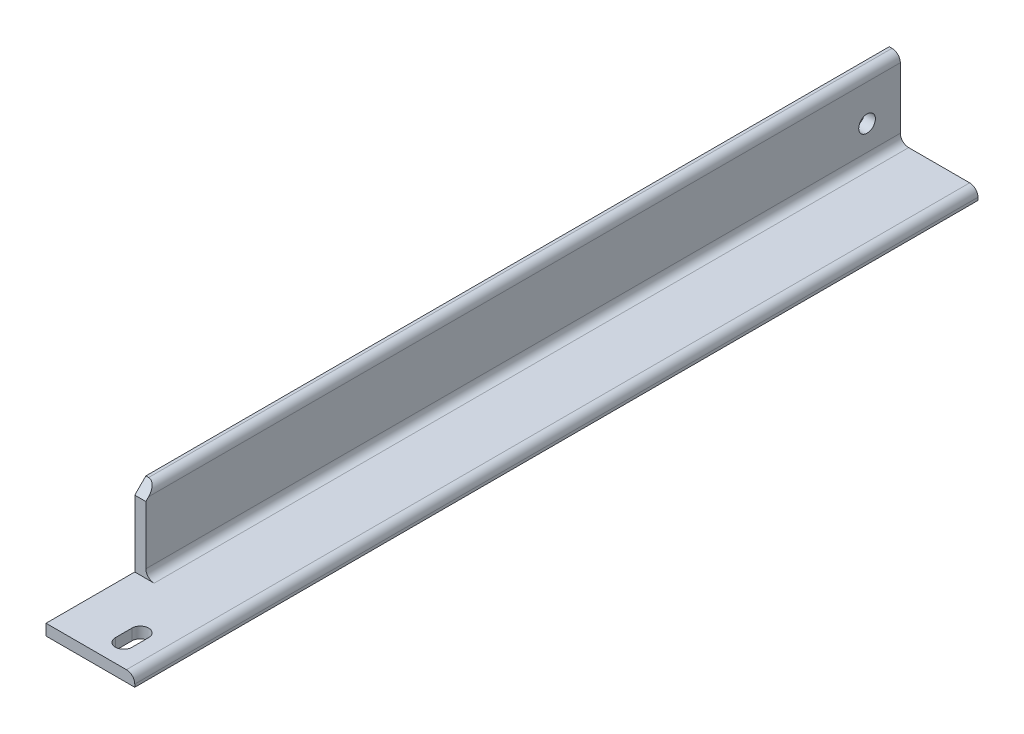
ISO-10303-21;
HEADER;
FILE_DESCRIPTION(('STEP AP214'),'2;1');
FILE_NAME('part.step','',(''),(''),'','','');
FILE_SCHEMA(('AUTOMOTIVE_DESIGN { 1 0 10303 214 1 1 1 1 }'));
ENDSEC;
DATA;
#1=APPLICATION_CONTEXT('core data for automotive mechanical design processes');
#2=APPLICATION_PROTOCOL_DEFINITION('international standard','automotive_design',2000,#1);
#3=PRODUCT_CONTEXT('',#1,'mechanical');
#4=PRODUCT('Part','Part','',(#3));
#5=PRODUCT_RELATED_PRODUCT_CATEGORY('part','',(#4));
#6=PRODUCT_DEFINITION_FORMATION('','',#4);
#7=PRODUCT_DEFINITION_CONTEXT('part definition',#1,'design');
#8=PRODUCT_DEFINITION('design','',#6,#7);
#9=PRODUCT_DEFINITION_SHAPE('','',#8);
#10=(LENGTH_UNIT() NAMED_UNIT(*) SI_UNIT(.MILLI.,.METRE.));
#11=(NAMED_UNIT(*) PLANE_ANGLE_UNIT() SI_UNIT($,.RADIAN.));
#12=(NAMED_UNIT(*) SI_UNIT($,.STERADIAN.) SOLID_ANGLE_UNIT());
#13=UNCERTAINTY_MEASURE_WITH_UNIT(LENGTH_MEASURE(1.E-05),#10,'distance_accuracy_value','');
#14=(GEOMETRIC_REPRESENTATION_CONTEXT(3) GLOBAL_UNCERTAINTY_ASSIGNED_CONTEXT((#13)) GLOBAL_UNIT_ASSIGNED_CONTEXT((#10,
#11,#12)) REPRESENTATION_CONTEXT('',''));
#15=CARTESIAN_POINT('',(0.,0.,0.));
#16=DIRECTION('',(0.,0.,1.));
#17=DIRECTION('',(1.,0.,0.));
#18=AXIS2_PLACEMENT_3D('',#15,#16,#17);
#19=CARTESIAN_POINT('',(0.,0.,482.6));
#20=DIRECTION('',(1.,0.,0.));
#21=DIRECTION('',(0.,0.,-1.));
#22=AXIS2_PLACEMENT_3D('',#19,#20,#21);
#23=PLANE('',#22);
#24=DIRECTION('',(0.,0.707106781186548,-0.707106781186548));
#25=VECTOR('',#24,1.);
#26=CARTESIAN_POINT('',(0.,88.9,381.));
#27=LINE('',#26,#25);
#28=CARTESIAN_POINT('',(0.,88.9,381.));
#29=VERTEX_POINT('',#28);
#30=CARTESIAN_POINT('',(0.,101.6,368.3));
#31=VERTEX_POINT('',#30);
#32=EDGE_CURVE('E166',#29,#31,#27,.T.);
#33=ORIENTED_EDGE('',*,*,#32,.T.);
#34=DIRECTION('',(0.,0.,-1.));
#35=VECTOR('',#34,1.);
#36=CARTESIAN_POINT('',(0.,101.6,482.6));
#37=LINE('',#36,#35);
#38=CARTESIAN_POINT('',(0.,101.6,-482.6));
#39=VERTEX_POINT('',#38);
#40=EDGE_CURVE('E222',#31,#39,#37,.T.);
#41=ORIENTED_EDGE('',*,*,#40,.T.);
#42=DIRECTION('',(0.,-1.,0.));
#43=VECTOR('',#42,1.);
#44=CARTESIAN_POINT('',(0.,0.,-482.6));
#45=LINE('',#44,#43);
#46=CARTESIAN_POINT('',(0.,0.,-482.6));
#47=VERTEX_POINT('',#46);
#48=EDGE_CURVE('E189',#39,#47,#45,.T.);
#49=ORIENTED_EDGE('',*,*,#48,.T.);
#50=DIRECTION('',(0.,0.,-1.));
#51=VECTOR('',#50,1.);
#52=CARTESIAN_POINT('',(0.,0.,482.6));
#53=LINE('',#52,#51);
#54=CARTESIAN_POINT('',(0.,0.,482.6));
#55=VERTEX_POINT('',#54);
#56=EDGE_CURVE('E197',#55,#47,#53,.T.);
#57=ORIENTED_EDGE('',*,*,#56,.F.);
#58=DIRECTION('',(0.,-1.,0.));
#59=VECTOR('',#58,1.);
#60=CARTESIAN_POINT('',(0.,0.,482.6));
#61=LINE('',#60,#59);
#62=CARTESIAN_POINT('',(0.,12.7,482.6));
#63=VERTEX_POINT('',#62);
#64=EDGE_CURVE('E195',#63,#55,#61,.T.);
#65=ORIENTED_EDGE('',*,*,#64,.F.);
#66=DIRECTION('',(0.,0.,-1.));
#67=VECTOR('',#66,1.);
#68=CARTESIAN_POINT('',(0.,12.7,482.6));
#69=LINE('',#68,#67);
#70=CARTESIAN_POINT('',(0.,12.7,381.));
#71=VERTEX_POINT('',#70);
#72=EDGE_CURVE('E160',#63,#71,#69,.T.);
#73=ORIENTED_EDGE('',*,*,#72,.T.);
#74=DIRECTION('',(0.,1.,0.));
#75=VECTOR('',#74,1.);
#76=CARTESIAN_POINT('',(0.,12.7,381.));
#77=LINE('',#76,#75);
#78=EDGE_CURVE('E163',#71,#29,#77,.T.);
#79=ORIENTED_EDGE('',*,*,#78,.T.);
#80=EDGE_LOOP('',(#33,#41,#49,#57,#65,#73,#79));
#81=FACE_BOUND('',#80,.T.);
#82=CARTESIAN_POINT('',(0.,50.8,-444.5));
#83=DIRECTION('',(-1.,0.,0.));
#84=DIRECTION('',(0.,0.,1.));
#85=AXIS2_PLACEMENT_3D('',#82,#83,#84);
#86=CIRCLE('',#85,9.525);
#87=CARTESIAN_POINT('',(0.,50.8,-434.975));
#88=VERTEX_POINT('',#87);
#89=EDGE_CURVE('E449',#88,#88,#86,.T.);
#90=ORIENTED_EDGE('',*,*,#89,.F.);
#91=EDGE_LOOP('',(#90));
#92=FACE_BOUND('',#91,.T.);
#93=ADVANCED_FACE('F17',(#81,#92),#23,.F.);
#94=CARTESIAN_POINT('',(101.6,0.,482.6));
#95=DIRECTION('',(0.,1.,0.));
#96=DIRECTION('',(-1.,0.,0.));
#97=AXIS2_PLACEMENT_3D('',#94,#95,#96);
#98=PLANE('',#97);
#99=DIRECTION('',(1.,0.,0.));
#100=VECTOR('',#99,1.);
#101=CARTESIAN_POINT('',(101.6,0.,-482.6));
#102=LINE('',#101,#100);
#103=CARTESIAN_POINT('',(101.6,0.,-482.6));
#104=VERTEX_POINT('',#103);
#105=EDGE_CURVE('E184',#47,#104,#102,.T.);
#106=ORIENTED_EDGE('',*,*,#105,.T.);
#107=DIRECTION('',(0.,0.,-1.));
#108=VECTOR('',#107,1.);
#109=CARTESIAN_POINT('',(101.6,0.,482.6));
#110=LINE('',#109,#108);
#111=CARTESIAN_POINT('',(101.6,0.,482.6));
#112=VERTEX_POINT('',#111);
#113=EDGE_CURVE('E11',#112,#104,#110,.T.);
#114=ORIENTED_EDGE('',*,*,#113,.F.);
#115=DIRECTION('',(1.,0.,0.));
#116=VECTOR('',#115,1.);
#117=CARTESIAN_POINT('',(101.6,0.,482.6));
#118=LINE('',#117,#116);
#119=EDGE_CURVE('E185',#55,#112,#118,.T.);
#120=ORIENTED_EDGE('',*,*,#119,.F.);
#121=ORIENTED_EDGE('',*,*,#56,.T.);
#122=EDGE_LOOP('',(#106,#114,#120,#121));
#123=FACE_BOUND('',#122,.T.);
#124=CARTESIAN_POINT('',(63.5,0.,457.2));
#125=DIRECTION('',(0.,1.,0.));
#126=DIRECTION('',(-1.,0.,0.));
#127=AXIS2_PLACEMENT_3D('',#124,#125,#126);
#128=CIRCLE('',#127,9.525);
#129=CARTESIAN_POINT('',(53.975,0.,457.2));
#130=VERTEX_POINT('',#129);
#131=CARTESIAN_POINT('',(73.025,0.,457.2));
#132=VERTEX_POINT('',#131);
#133=EDGE_CURVE('E32',#130,#132,#128,.T.);
#134=ORIENTED_EDGE('',*,*,#133,.T.);
#135=DIRECTION('',(0.,0.,-1.));
#136=VECTOR('',#135,1.);
#137=CARTESIAN_POINT('',(73.025,0.,457.2));
#138=LINE('',#137,#136);
#139=CARTESIAN_POINT('',(73.025,0.,438.15));
#140=VERTEX_POINT('',#139);
#141=EDGE_CURVE('E142',#132,#140,#138,.T.);
#142=ORIENTED_EDGE('',*,*,#141,.T.);
#143=CARTESIAN_POINT('',(63.5,0.,438.15));
#144=DIRECTION('',(0.,1.,0.));
#145=DIRECTION('',(-1.,0.,0.));
#146=AXIS2_PLACEMENT_3D('',#143,#144,#145);
#147=CIRCLE('',#146,9.525);
#148=CARTESIAN_POINT('',(53.975,0.,438.15));
#149=VERTEX_POINT('',#148);
#150=EDGE_CURVE('E150',#140,#149,#147,.T.);
#151=ORIENTED_EDGE('',*,*,#150,.T.);
#152=DIRECTION('',(0.,0.,1.));
#153=VECTOR('',#152,1.);
#154=CARTESIAN_POINT('',(53.975,0.,457.2));
#155=LINE('',#154,#153);
#156=EDGE_CURVE('E136',#149,#130,#155,.T.);
#157=ORIENTED_EDGE('',*,*,#156,.T.);
#158=EDGE_LOOP('',(#134,#142,#151,#157));
#159=FACE_BOUND('',#158,.T.);
#160=ADVANCED_FACE('F19',(#123,#159),#98,.F.);
#161=CARTESIAN_POINT('',(22.225,12.7,482.6));
#162=DIRECTION('',(0.,-1.,0.));
#163=DIRECTION('',(1.,0.,0.));
#164=AXIS2_PLACEMENT_3D('',#161,#162,#163);
#165=PLANE('',#164);
#166=DIRECTION('',(-1.,0.,0.));
#167=VECTOR('',#166,1.);
#168=CARTESIAN_POINT('',(22.225,12.7,-482.6));
#169=LINE('',#168,#167);
#170=CARTESIAN_POINT('',(92.08008,12.7,-482.6));
#171=VERTEX_POINT('',#170);
#172=CARTESIAN_POINT('',(22.225,12.7,-482.6));
#173=VERTEX_POINT('',#172);
#174=EDGE_CURVE('E204',#171,#173,#169,.T.);
#175=ORIENTED_EDGE('',*,*,#174,.T.);
#176=DIRECTION('',(0.,0.,-1.));
#177=VECTOR('',#176,1.);
#178=CARTESIAN_POINT('',(22.225,12.7,482.6));
#179=LINE('',#178,#177);
#180=CARTESIAN_POINT('',(22.225,12.7,381.));
#181=VERTEX_POINT('',#180);
#182=EDGE_CURVE('E230',#181,#173,#179,.T.);
#183=ORIENTED_EDGE('',*,*,#182,.F.);
#184=DIRECTION('',(-1.,0.,0.));
#185=VECTOR('',#184,1.);
#186=CARTESIAN_POINT('',(101.601,12.7,381.));
#187=LINE('',#186,#185);
#188=EDGE_CURVE('E173',#181,#71,#187,.T.);
#189=ORIENTED_EDGE('',*,*,#188,.T.);
#190=ORIENTED_EDGE('',*,*,#72,.F.);
#191=DIRECTION('',(-1.,0.,0.));
#192=VECTOR('',#191,1.);
#193=CARTESIAN_POINT('',(22.225,12.7,482.6));
#194=LINE('',#193,#192);
#195=CARTESIAN_POINT('',(92.08008,12.7,482.6));
#196=VERTEX_POINT('',#195);
#197=EDGE_CURVE('E193',#196,#63,#194,.T.);
#198=ORIENTED_EDGE('',*,*,#197,.F.);
#199=DIRECTION('',(0.,0.,-1.));
#200=VECTOR('',#199,1.);
#201=CARTESIAN_POINT('',(92.08008,12.7,482.6));
#202=LINE('',#201,#200);
#203=EDGE_CURVE('E232',#196,#171,#202,.T.);
#204=ORIENTED_EDGE('',*,*,#203,.T.);
#205=EDGE_LOOP('',(#175,#183,#189,#190,#198,#204));
#206=FACE_BOUND('',#205,.T.);
#207=CARTESIAN_POINT('',(63.5,12.7,457.2));
#208=DIRECTION('',(0.,-1.,0.));
#209=DIRECTION('',(1.,0.,0.));
#210=AXIS2_PLACEMENT_3D('',#207,#208,#209);
#211=CIRCLE('',#210,9.525);
#212=CARTESIAN_POINT('',(73.025,12.7,457.2));
#213=VERTEX_POINT('',#212);
#214=CARTESIAN_POINT('',(53.975,12.7,457.2));
#215=VERTEX_POINT('',#214);
#216=EDGE_CURVE('E134',#213,#215,#211,.T.);
#217=ORIENTED_EDGE('',*,*,#216,.T.);
#218=DIRECTION('',(0.,0.,-1.));
#219=VECTOR('',#218,1.);
#220=CARTESIAN_POINT('',(53.975,12.7,457.2));
#221=LINE('',#220,#219);
#222=CARTESIAN_POINT('',(53.975,12.7,438.15));
#223=VERTEX_POINT('',#222);
#224=EDGE_CURVE('E123',#215,#223,#221,.T.);
#225=ORIENTED_EDGE('',*,*,#224,.T.);
#226=CARTESIAN_POINT('',(63.5,12.7,438.15));
#227=DIRECTION('',(0.,-1.,0.));
#228=DIRECTION('',(1.,0.,0.));
#229=AXIS2_PLACEMENT_3D('',#226,#227,#228);
#230=CIRCLE('',#229,9.525);
#231=CARTESIAN_POINT('',(73.025,12.7,438.15));
#232=VERTEX_POINT('',#231);
#233=EDGE_CURVE('E144',#223,#232,#230,.T.);
#234=ORIENTED_EDGE('',*,*,#233,.T.);
#235=DIRECTION('',(0.,0.,1.));
#236=VECTOR('',#235,1.);
#237=CARTESIAN_POINT('',(73.025,12.7,457.2));
#238=LINE('',#237,#236);
#239=EDGE_CURVE('E140',#232,#213,#238,.T.);
#240=ORIENTED_EDGE('',*,*,#239,.T.);
#241=EDGE_LOOP('',(#217,#225,#234,#240));
#242=FACE_BOUND('',#241,.T.);
#243=ADVANCED_FACE('F139',(#206,#242),#165,.F.);
#244=CARTESIAN_POINT('',(22.225,22.225,482.6));
#245=DIRECTION('',(0.,0.,-1.));
#246=DIRECTION('',(-1.,0.,0.));
#247=AXIS2_PLACEMENT_3D('',#244,#245,#246);
#248=CYLINDRICAL_SURFACE('',#247,9.525);
#249=CARTESIAN_POINT('',(22.225,22.225,381.));
#250=DIRECTION('',(0.,0.,1.));
#251=DIRECTION('',(1.,0.,0.));
#252=AXIS2_PLACEMENT_3D('',#249,#250,#251);
#253=CIRCLE('',#252,9.525);
#254=CARTESIAN_POINT('',(12.7,22.225,381.));
#255=VERTEX_POINT('',#254);
#256=EDGE_CURVE('E181',#255,#181,#253,.T.);
#257=ORIENTED_EDGE('',*,*,#256,.T.);
#258=ORIENTED_EDGE('',*,*,#182,.T.);
#259=CARTESIAN_POINT('',(22.225,22.225,-482.6));
#260=DIRECTION('',(0.,0.,-1.));
#261=DIRECTION('',(-1.,0.,0.));
#262=AXIS2_PLACEMENT_3D('',#259,#260,#261);
#263=CIRCLE('',#262,9.525);
#264=CARTESIAN_POINT('',(12.7,22.225,-482.6));
#265=VERTEX_POINT('',#264);
#266=EDGE_CURVE('E207',#173,#265,#263,.T.);
#267=ORIENTED_EDGE('',*,*,#266,.T.);
#268=DIRECTION('',(0.,0.,-1.));
#269=VECTOR('',#268,1.);
#270=CARTESIAN_POINT('',(12.7,22.225,482.6));
#271=LINE('',#270,#269);
#272=EDGE_CURVE('E228',#255,#265,#271,.T.);
#273=ORIENTED_EDGE('',*,*,#272,.F.);
#274=EDGE_LOOP('',(#257,#258,#267,#273));
#275=FACE_BOUND('',#274,.T.);
#276=ADVANCED_FACE('F279',(#275),#248,.F.);
#277=CARTESIAN_POINT('',(12.7,92.08008,482.6));
#278=DIRECTION('',(-1.,0.,0.));
#279=DIRECTION('',(0.,-1.,0.));
#280=AXIS2_PLACEMENT_3D('',#277,#278,#279);
#281=PLANE('',#280);
#282=CARTESIAN_POINT('',(12.7,50.8,-444.5));
#283=DIRECTION('',(-1.,0.,0.));
#284=DIRECTION('',(0.,-1.,0.));
#285=AXIS2_PLACEMENT_3D('',#282,#283,#284);
#286=CIRCLE('',#285,9.525);
#287=CARTESIAN_POINT('',(12.7,41.275,-444.5));
#288=VERTEX_POINT('',#287);
#289=EDGE_CURVE('E446',#288,#288,#286,.T.);
#290=ORIENTED_EDGE('',*,*,#289,.T.);
#291=EDGE_LOOP('',(#290));
#292=FACE_BOUND('',#291,.T.);
#293=DIRECTION('',(0.,-1.,0.));
#294=VECTOR('',#293,1.);
#295=CARTESIAN_POINT('',(12.7,12.7,381.));
#296=LINE('',#295,#294);
#297=CARTESIAN_POINT('',(12.7,88.9,381.));
#298=VERTEX_POINT('',#297);
#299=EDGE_CURVE('E130',#298,#255,#296,.T.);
#300=ORIENTED_EDGE('',*,*,#299,.T.);
#301=ORIENTED_EDGE('',*,*,#272,.T.);
#302=DIRECTION('',(0.,1.,0.));
#303=VECTOR('',#302,1.);
#304=CARTESIAN_POINT('',(12.7,92.08008,-482.6));
#305=LINE('',#304,#303);
#306=CARTESIAN_POINT('',(12.7,92.08008,-482.6));
#307=VERTEX_POINT('',#306);
#308=EDGE_CURVE('E210',#265,#307,#305,.T.);
#309=ORIENTED_EDGE('',*,*,#308,.T.);
#310=DIRECTION('',(0.,0.,-1.));
#311=VECTOR('',#310,1.);
#312=CARTESIAN_POINT('',(12.7,92.08008,482.6));
#313=LINE('',#312,#311);
#314=CARTESIAN_POINT('',(12.7,92.08008,377.81992));
#315=VERTEX_POINT('',#314);
#316=EDGE_CURVE('E226',#315,#307,#313,.T.);
#317=ORIENTED_EDGE('',*,*,#316,.F.);
#318=DIRECTION('',(0.,-0.707106781186548,0.707106781186548));
#319=VECTOR('',#318,1.);
#320=CARTESIAN_POINT('',(12.7,88.9,381.));
#321=LINE('',#320,#319);
#322=EDGE_CURVE('E178',#315,#298,#321,.T.);
#323=ORIENTED_EDGE('',*,*,#322,.T.);
#324=EDGE_LOOP('',(#300,#301,#309,#317,#323));
#325=FACE_BOUND('',#324,.T.);
#326=ADVANCED_FACE('F276',(#292,#325),#281,.F.);
#327=CARTESIAN_POINT('',(3.18008,92.08008,482.6));
#328=DIRECTION('',(0.,0.,-1.));
#329=DIRECTION('',(-1.,0.,0.));
#330=AXIS2_PLACEMENT_3D('',#327,#328,#329);
#331=CYLINDRICAL_SURFACE('',#330,9.51992);
#332=CARTESIAN_POINT('',(3.18008,92.08008,377.81992));
#333=DIRECTION('',(0.,0.707106781186548,0.707106781186548));
#334=DIRECTION('',(0.,0.707106781186548,-0.707106781186548));
#335=AXIS2_PLACEMENT_3D('',#332,#333,#334);
#336=ELLIPSE('',#335,13.4631999767069,9.51992);
#337=CARTESIAN_POINT('',(3.18008,101.6,368.3));
#338=VERTEX_POINT('',#337);
#339=EDGE_CURVE('E175',#338,#315,#336,.F.);
#340=ORIENTED_EDGE('',*,*,#339,.T.);
#341=ORIENTED_EDGE('',*,*,#316,.T.);
#342=CARTESIAN_POINT('',(3.18008,92.08008,-482.6));
#343=DIRECTION('',(0.,0.,1.));
#344=DIRECTION('',(-1.,0.,0.));
#345=AXIS2_PLACEMENT_3D('',#342,#343,#344);
#346=CIRCLE('',#345,9.51992);
#347=CARTESIAN_POINT('',(3.18008,101.6,-482.6));
#348=VERTEX_POINT('',#347);
#349=EDGE_CURVE('E213',#307,#348,#346,.T.);
#350=ORIENTED_EDGE('',*,*,#349,.T.);
#351=DIRECTION('',(0.,0.,-1.));
#352=VECTOR('',#351,1.);
#353=CARTESIAN_POINT('',(3.18008,101.6,482.6));
#354=LINE('',#353,#352);
#355=EDGE_CURVE('E224',#338,#348,#354,.T.);
#356=ORIENTED_EDGE('',*,*,#355,.F.);
#357=EDGE_LOOP('',(#340,#341,#350,#356));
#358=FACE_BOUND('',#357,.T.);
#359=ADVANCED_FACE('F273',(#358),#331,.T.);
#360=CARTESIAN_POINT('',(0.,101.6,482.6));
#361=DIRECTION('',(0.,-1.,0.));
#362=DIRECTION('',(0.,0.,-1.));
#363=AXIS2_PLACEMENT_3D('',#360,#361,#362);
#364=PLANE('',#363);
#365=DIRECTION('',(-1.,0.,0.));
#366=VECTOR('',#365,1.);
#367=CARTESIAN_POINT('',(101.601,101.6,368.3));
#368=LINE('',#367,#366);
#369=EDGE_CURVE('E169',#338,#31,#368,.T.);
#370=ORIENTED_EDGE('',*,*,#369,.F.);
#371=ORIENTED_EDGE('',*,*,#355,.T.);
#372=DIRECTION('',(-1.,0.,0.));
#373=VECTOR('',#372,1.);
#374=CARTESIAN_POINT('',(0.,101.6,-482.6));
#375=LINE('',#374,#373);
#376=EDGE_CURVE('E216',#348,#39,#375,.T.);
#377=ORIENTED_EDGE('',*,*,#376,.T.);
#378=ORIENTED_EDGE('',*,*,#40,.F.);
#379=EDGE_LOOP('',(#370,#371,#377,#378));
#380=FACE_BOUND('',#379,.T.);
#381=ADVANCED_FACE('F270',(#380),#364,.F.);
#382=CARTESIAN_POINT('',(3.18008,92.08008,482.6));
#383=DIRECTION('',(0.,0.,-1.));
#384=DIRECTION('',(-1.,0.,0.));
#385=AXIS2_PLACEMENT_3D('',#382,#383,#384);
#386=PLANE('',#385);
#387=ORIENTED_EDGE('',*,*,#197,.T.);
#388=ORIENTED_EDGE('',*,*,#64,.T.);
#389=ORIENTED_EDGE('',*,*,#119,.T.);
#390=DIRECTION('',(0.,1.,0.));
#391=VECTOR('',#390,1.);
#392=CARTESIAN_POINT('',(101.6,3.18008,482.6));
#393=LINE('',#392,#391);
#394=CARTESIAN_POINT('',(101.6,3.18008,482.6));
#395=VERTEX_POINT('',#394);
#396=EDGE_CURVE('E188',#112,#395,#393,.T.);
#397=ORIENTED_EDGE('',*,*,#396,.T.);
#398=CARTESIAN_POINT('',(92.08008,3.18008,482.6));
#399=DIRECTION('',(0.,0.,1.));
#400=DIRECTION('',(1.,0.,0.));
#401=AXIS2_PLACEMENT_3D('',#398,#399,#400);
#402=CIRCLE('',#401,9.51992);
#403=EDGE_CURVE('E191',#395,#196,#402,.T.);
#404=ORIENTED_EDGE('',*,*,#403,.T.);
#405=EDGE_LOOP('',(#387,#388,#389,#397,#404));
#406=FACE_BOUND('',#405,.T.);
#407=ADVANCED_FACE('F254',(#406),#386,.F.);
#408=CARTESIAN_POINT('',(101.6,3.18008,482.6));
#409=DIRECTION('',(-1.,0.,0.));
#410=DIRECTION('',(0.,0.,1.));
#411=AXIS2_PLACEMENT_3D('',#408,#409,#410);
#412=PLANE('',#411);
#413=DIRECTION('',(0.,1.,0.));
#414=VECTOR('',#413,1.);
#415=CARTESIAN_POINT('',(101.6,3.18008,-482.6));
#416=LINE('',#415,#414);
#417=CARTESIAN_POINT('',(101.6,3.18008,-482.6));
#418=VERTEX_POINT('',#417);
#419=EDGE_CURVE('E200',#104,#418,#416,.T.);
#420=ORIENTED_EDGE('',*,*,#419,.T.);
#421=DIRECTION('',(0.,0.,-1.));
#422=VECTOR('',#421,1.);
#423=CARTESIAN_POINT('',(101.6,3.18008,482.6));
#424=LINE('',#423,#422);
#425=EDGE_CURVE('E25',#395,#418,#424,.T.);
#426=ORIENTED_EDGE('',*,*,#425,.F.);
#427=ORIENTED_EDGE('',*,*,#396,.F.);
#428=ORIENTED_EDGE('',*,*,#113,.T.);
#429=EDGE_LOOP('',(#420,#426,#427,#428));
#430=FACE_BOUND('',#429,.T.);
#431=ADVANCED_FACE('F258',(#430),#412,.F.);
#432=CARTESIAN_POINT('',(92.08008,3.18008,482.6));
#433=DIRECTION('',(0.,0.,-1.));
#434=DIRECTION('',(-1.,0.,0.));
#435=AXIS2_PLACEMENT_3D('',#432,#433,#434);
#436=CYLINDRICAL_SURFACE('',#435,9.51992);
#437=CARTESIAN_POINT('',(92.08008,3.18008,-482.6));
#438=DIRECTION('',(0.,0.,1.));
#439=DIRECTION('',(1.,0.,0.));
#440=AXIS2_PLACEMENT_3D('',#437,#438,#439);
#441=CIRCLE('',#440,9.51992);
#442=EDGE_CURVE('E202',#418,#171,#441,.T.);
#443=ORIENTED_EDGE('',*,*,#442,.T.);
#444=ORIENTED_EDGE('',*,*,#203,.F.);
#445=ORIENTED_EDGE('',*,*,#403,.F.);
#446=ORIENTED_EDGE('',*,*,#425,.T.);
#447=EDGE_LOOP('',(#443,#444,#445,#446));
#448=FACE_BOUND('',#447,.T.);
#449=ADVANCED_FACE('F239',(#448),#436,.T.);
#450=CARTESIAN_POINT('',(3.18008,92.08008,-482.6));
#451=DIRECTION('',(0.,0.,-1.));
#452=DIRECTION('',(-1.,0.,0.));
#453=AXIS2_PLACEMENT_3D('',#450,#451,#452);
#454=PLANE('',#453);
#455=ORIENTED_EDGE('',*,*,#105,.F.);
#456=ORIENTED_EDGE('',*,*,#48,.F.);
#457=ORIENTED_EDGE('',*,*,#376,.F.);
#458=ORIENTED_EDGE('',*,*,#349,.F.);
#459=ORIENTED_EDGE('',*,*,#308,.F.);
#460=ORIENTED_EDGE('',*,*,#266,.F.);
#461=ORIENTED_EDGE('',*,*,#174,.F.);
#462=ORIENTED_EDGE('',*,*,#442,.F.);
#463=ORIENTED_EDGE('',*,*,#419,.F.);
#464=EDGE_LOOP('',(#455,#456,#457,#458,#459,#460,#461,#462,#463));
#465=FACE_BOUND('',#464,.T.);
#466=ADVANCED_FACE('F245',(#465),#454,.T.);
#467=CARTESIAN_POINT('',(101.601,12.7,381.));
#468=DIRECTION('',(0.,0.,1.));
#469=DIRECTION('',(1.,0.,0.));
#470=AXIS2_PLACEMENT_3D('',#467,#468,#469);
#471=PLANE('',#470);
#472=ORIENTED_EDGE('',*,*,#299,.F.);
#473=DIRECTION('',(-1.,0.,0.));
#474=VECTOR('',#473,1.);
#475=CARTESIAN_POINT('',(101.601,88.9,381.));
#476=LINE('',#475,#474);
#477=EDGE_CURVE('E171',#298,#29,#476,.T.);
#478=ORIENTED_EDGE('',*,*,#477,.T.);
#479=ORIENTED_EDGE('',*,*,#78,.F.);
#480=ORIENTED_EDGE('',*,*,#188,.F.);
#481=ORIENTED_EDGE('',*,*,#256,.F.);
#482=EDGE_LOOP('',(#472,#478,#479,#480,#481));
#483=FACE_BOUND('',#482,.T.);
#484=ADVANCED_FACE('F281',(#483),#471,.T.);
#485=CARTESIAN_POINT('',(101.601,88.9,381.));
#486=DIRECTION('',(0.,0.707106781186548,0.707106781186548));
#487=DIRECTION('',(0.,-0.707106781186548,0.707106781186548));
#488=AXIS2_PLACEMENT_3D('',#485,#486,#487);
#489=PLANE('',#488);
#490=ORIENTED_EDGE('',*,*,#339,.F.);
#491=ORIENTED_EDGE('',*,*,#369,.T.);
#492=ORIENTED_EDGE('',*,*,#32,.F.);
#493=ORIENTED_EDGE('',*,*,#477,.F.);
#494=ORIENTED_EDGE('',*,*,#322,.F.);
#495=EDGE_LOOP('',(#490,#491,#492,#493,#494));
#496=FACE_BOUND('',#495,.T.);
#497=ADVANCED_FACE('F285',(#496),#489,.T.);
#498=CARTESIAN_POINT('',(63.5,101.601,457.2));
#499=DIRECTION('',(0.,-1.,0.));
#500=DIRECTION('',(1.,0.,0.));
#501=AXIS2_PLACEMENT_3D('',#498,#499,#500);
#502=CYLINDRICAL_SURFACE('',#501,9.525);
#503=DIRECTION('',(0.,-1.,0.));
#504=VECTOR('',#503,1.);
#505=CARTESIAN_POINT('',(73.025,101.601,457.2));
#506=LINE('',#505,#504);
#507=EDGE_CURVE('E131',#213,#132,#506,.T.);
#508=ORIENTED_EDGE('',*,*,#507,.T.);
#509=ORIENTED_EDGE('',*,*,#133,.F.);
#510=DIRECTION('',(0.,-1.,0.));
#511=VECTOR('',#510,1.);
#512=CARTESIAN_POINT('',(53.975,101.601,457.2));
#513=LINE('',#512,#511);
#514=EDGE_CURVE('E125',#215,#130,#513,.T.);
#515=ORIENTED_EDGE('',*,*,#514,.F.);
#516=ORIENTED_EDGE('',*,*,#216,.F.);
#517=EDGE_LOOP('',(#508,#509,#515,#516));
#518=FACE_BOUND('',#517,.T.);
#519=ADVANCED_FACE('F133',(#518),#502,.F.);
#520=CARTESIAN_POINT('',(73.025,101.601,457.2));
#521=DIRECTION('',(-1.,0.,0.));
#522=DIRECTION('',(0.,0.,1.));
#523=AXIS2_PLACEMENT_3D('',#520,#521,#522);
#524=PLANE('',#523);
#525=DIRECTION('',(0.,-1.,0.));
#526=VECTOR('',#525,1.);
#527=CARTESIAN_POINT('',(73.025,101.601,438.15));
#528=LINE('',#527,#526);
#529=EDGE_CURVE('E155',#232,#140,#528,.T.);
#530=ORIENTED_EDGE('',*,*,#529,.T.);
#531=ORIENTED_EDGE('',*,*,#141,.F.);
#532=ORIENTED_EDGE('',*,*,#507,.F.);
#533=ORIENTED_EDGE('',*,*,#239,.F.);
#534=EDGE_LOOP('',(#530,#531,#532,#533));
#535=FACE_BOUND('',#534,.T.);
#536=ADVANCED_FACE('F294',(#535),#524,.T.);
#537=CARTESIAN_POINT('',(63.5,101.601,438.15));
#538=DIRECTION('',(0.,-1.,0.));
#539=DIRECTION('',(1.,0.,0.));
#540=AXIS2_PLACEMENT_3D('',#537,#538,#539);
#541=CYLINDRICAL_SURFACE('',#540,9.525);
#542=DIRECTION('',(0.,-1.,0.));
#543=VECTOR('',#542,1.);
#544=CARTESIAN_POINT('',(53.975,101.601,438.15));
#545=LINE('',#544,#543);
#546=EDGE_CURVE('E40',#223,#149,#545,.T.);
#547=ORIENTED_EDGE('',*,*,#546,.T.);
#548=ORIENTED_EDGE('',*,*,#150,.F.);
#549=ORIENTED_EDGE('',*,*,#529,.F.);
#550=ORIENTED_EDGE('',*,*,#233,.F.);
#551=EDGE_LOOP('',(#547,#548,#549,#550));
#552=FACE_BOUND('',#551,.T.);
#553=ADVANCED_FACE('F388',(#552),#541,.F.);
#554=CARTESIAN_POINT('',(53.975,101.601,457.2));
#555=DIRECTION('',(1.,0.,0.));
#556=DIRECTION('',(0.,1.,0.));
#557=AXIS2_PLACEMENT_3D('',#554,#555,#556);
#558=PLANE('',#557);
#559=ORIENTED_EDGE('',*,*,#514,.T.);
#560=ORIENTED_EDGE('',*,*,#156,.F.);
#561=ORIENTED_EDGE('',*,*,#546,.F.);
#562=ORIENTED_EDGE('',*,*,#224,.F.);
#563=EDGE_LOOP('',(#559,#560,#561,#562));
#564=FACE_BOUND('',#563,.T.);
#565=ADVANCED_FACE('F124',(#564),#558,.T.);
#566=CARTESIAN_POINT('',(0.,50.8,-444.5));
#567=DIRECTION('',(-1.,0.,0.));
#568=DIRECTION('',(0.,0.,1.));
#569=AXIS2_PLACEMENT_3D('',#566,#567,#568);
#570=CYLINDRICAL_SURFACE('',#569,9.525);
#571=ORIENTED_EDGE('',*,*,#289,.F.);
#572=EDGE_LOOP('',(#571));
#573=FACE_BOUND('',#572,.T.);
#574=ORIENTED_EDGE('',*,*,#89,.T.);
#575=EDGE_LOOP('',(#574));
#576=FACE_BOUND('',#575,.T.);
#577=ADVANCED_FACE('F407',(#573,#576),#570,.F.);
#578=CLOSED_SHELL('',(#93,#160,#243,#276,#326,#359,#381,#407,#431,#449,#466,#484,#497,#519,#536,
#553,#565,#577));
#579=MANIFOLD_SOLID_BREP('B1',#578);
#580=ADVANCED_BREP_SHAPE_REPRESENTATION('',(#18,#579),#14);
#581=SHAPE_DEFINITION_REPRESENTATION(#9,#580);
ENDSEC;
END-ISO-10303-21;
